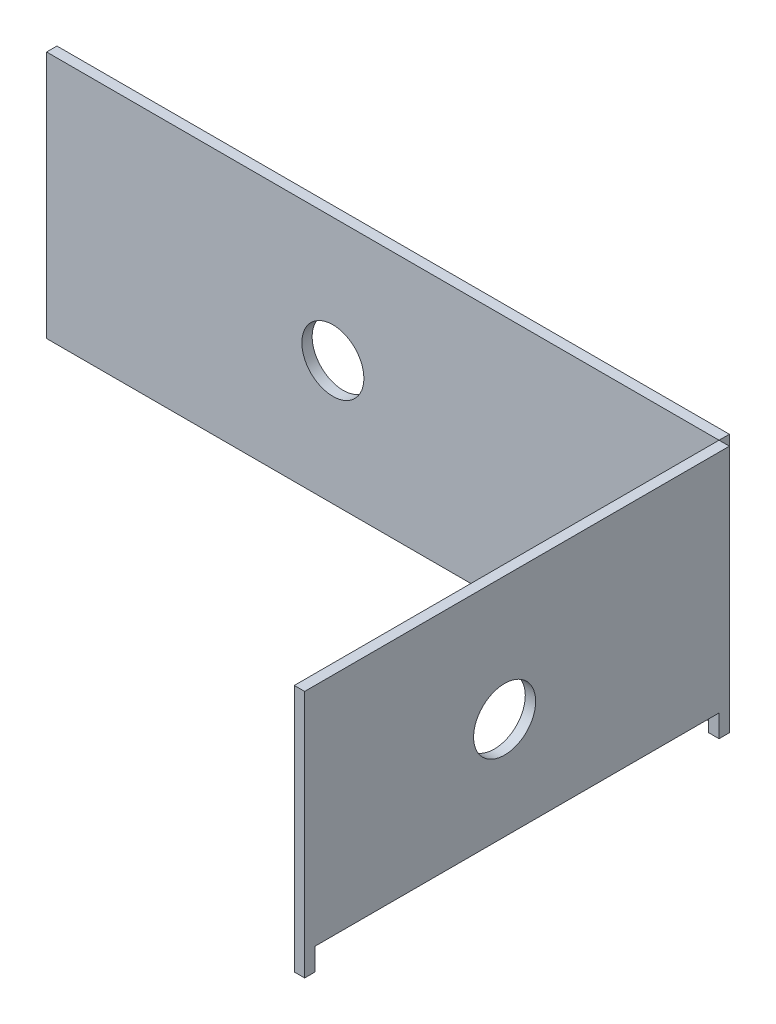
ISO-10303-21;
HEADER;
FILE_DESCRIPTION(('STEP AP214'),'2;1');
FILE_NAME('part.step','',(''),(''),'','','');
FILE_SCHEMA(('AUTOMOTIVE_DESIGN { 1 0 10303 214 1 1 1 1 }'));
ENDSEC;
DATA;
#1=APPLICATION_CONTEXT('core data for automotive mechanical design processes');
#2=APPLICATION_PROTOCOL_DEFINITION('international standard','automotive_design',2000,#1);
#3=PRODUCT_CONTEXT('',#1,'mechanical');
#4=PRODUCT('Part','Part','',(#3));
#5=PRODUCT_RELATED_PRODUCT_CATEGORY('part','',(#4));
#6=PRODUCT_DEFINITION_FORMATION('','',#4);
#7=PRODUCT_DEFINITION_CONTEXT('part definition',#1,'design');
#8=PRODUCT_DEFINITION('design','',#6,#7);
#9=PRODUCT_DEFINITION_SHAPE('','',#8);
#10=(LENGTH_UNIT() NAMED_UNIT(*) SI_UNIT(.MILLI.,.METRE.));
#11=(NAMED_UNIT(*) PLANE_ANGLE_UNIT() SI_UNIT($,.RADIAN.));
#12=(NAMED_UNIT(*) SI_UNIT($,.STERADIAN.) SOLID_ANGLE_UNIT());
#13=UNCERTAINTY_MEASURE_WITH_UNIT(LENGTH_MEASURE(1.E-05),#10,'distance_accuracy_value','');
#14=(GEOMETRIC_REPRESENTATION_CONTEXT(3) GLOBAL_UNCERTAINTY_ASSIGNED_CONTEXT((#13)) GLOBAL_UNIT_ASSIGNED_CONTEXT((#10,
#11,#12)) REPRESENTATION_CONTEXT('',''));
#15=CARTESIAN_POINT('',(0.,0.,0.));
#16=DIRECTION('',(0.,0.,1.));
#17=DIRECTION('',(1.,0.,0.));
#18=AXIS2_PLACEMENT_3D('',#15,#16,#17);
#19=CARTESIAN_POINT('',(169.541152356219,0.,0.));
#20=DIRECTION('',(-1.,0.,0.));
#21=DIRECTION('',(0.,0.,1.));
#22=AXIS2_PLACEMENT_3D('',#19,#20,#21);
#23=PLANE('',#22);
#24=DIRECTION('',(0.,1.,0.));
#25=VECTOR('',#24,1.);
#26=CARTESIAN_POINT('',(169.541152356219,0.,3.175));
#27=LINE('',#26,#25);
#28=CARTESIAN_POINT('',(169.541152356219,-76.2,3.175));
#29=VERTEX_POINT('',#28);
#30=CARTESIAN_POINT('',(169.541152356219,0.,3.175));
#31=VERTEX_POINT('',#30);
#32=EDGE_CURVE('E178',#29,#31,#27,.T.);
#33=ORIENTED_EDGE('',*,*,#32,.T.);
#34=DIRECTION('',(0.,0.,1.));
#35=VECTOR('',#34,1.);
#36=CARTESIAN_POINT('',(169.541152356219,0.,3.175));
#37=LINE('',#36,#35);
#38=CARTESIAN_POINT('',(169.541152356219,0.,133.5786));
#39=VERTEX_POINT('',#38);
#40=EDGE_CURVE('E126',#31,#39,#37,.T.);
#41=ORIENTED_EDGE('',*,*,#40,.T.);
#42=DIRECTION('',(0.,-1.,0.));
#43=VECTOR('',#42,1.);
#44=CARTESIAN_POINT('',(169.541152356219,-76.2,133.5786));
#45=LINE('',#44,#43);
#46=CARTESIAN_POINT('',(169.541152356219,-76.2,133.5786));
#47=VERTEX_POINT('',#46);
#48=EDGE_CURVE('E193',#39,#47,#45,.T.);
#49=ORIENTED_EDGE('',*,*,#48,.T.);
#50=DIRECTION('',(0.,0.,-1.));
#51=VECTOR('',#50,1.);
#52=CARTESIAN_POINT('',(169.541152356219,-76.2,130.4036));
#53=LINE('',#52,#51);
#54=CARTESIAN_POINT('',(169.541152356219,-76.2,130.4036));
#55=VERTEX_POINT('',#54);
#56=EDGE_CURVE('E206',#47,#55,#53,.T.);
#57=ORIENTED_EDGE('',*,*,#56,.T.);
#58=DIRECTION('',(0.,1.,0.));
#59=VECTOR('',#58,1.);
#60=CARTESIAN_POINT('',(169.541152356219,-69.342,130.4036));
#61=LINE('',#60,#59);
#62=CARTESIAN_POINT('',(169.541152356219,-69.342,130.4036));
#63=VERTEX_POINT('',#62);
#64=EDGE_CURVE('E145',#55,#63,#61,.T.);
#65=ORIENTED_EDGE('',*,*,#64,.T.);
#66=DIRECTION('',(0.,0.,-1.));
#67=VECTOR('',#66,1.);
#68=CARTESIAN_POINT('',(169.541152356219,-69.342,6.35));
#69=LINE('',#68,#67);
#70=CARTESIAN_POINT('',(169.541152356219,-69.342,6.35));
#71=VERTEX_POINT('',#70);
#72=EDGE_CURVE('E139',#63,#71,#69,.T.);
#73=ORIENTED_EDGE('',*,*,#72,.T.);
#74=DIRECTION('',(0.,-1.,0.));
#75=VECTOR('',#74,1.);
#76=CARTESIAN_POINT('',(169.541152356219,-76.2,6.35));
#77=LINE('',#76,#75);
#78=CARTESIAN_POINT('',(169.541152356219,-76.2,6.35));
#79=VERTEX_POINT('',#78);
#80=EDGE_CURVE('E143',#71,#79,#77,.T.);
#81=ORIENTED_EDGE('',*,*,#80,.T.);
#82=DIRECTION('',(0.,0.,-1.));
#83=VECTOR('',#82,1.);
#84=CARTESIAN_POINT('',(169.541152356219,-76.2,3.175));
#85=LINE('',#84,#83);
#86=EDGE_CURVE('E83',#79,#29,#85,.T.);
#87=ORIENTED_EDGE('',*,*,#86,.T.);
#88=EDGE_LOOP('',(#33,#41,#49,#57,#65,#73,#81,#87));
#89=FACE_BOUND('',#88,.T.);
#90=CARTESIAN_POINT('',(169.541152356219,-38.1,72.1868));
#91=DIRECTION('',(1.,0.,0.));
#92=DIRECTION('',(0.,0.,-1.));
#93=AXIS2_PLACEMENT_3D('',#90,#91,#92);
#94=CIRCLE('',#93,9.52500000000001);
#95=CARTESIAN_POINT('',(169.541152356219,-38.1,62.6618));
#96=VERTEX_POINT('',#95);
#97=EDGE_CURVE('E167',#96,#96,#94,.T.);
#98=ORIENTED_EDGE('',*,*,#97,.F.);
#99=EDGE_LOOP('',(#98));
#100=FACE_BOUND('',#99,.T.);
#101=ADVANCED_FACE('F66',(#89,#100),#23,.F.);
#102=CARTESIAN_POINT('',(166.366152356219,0.,0.));
#103=DIRECTION('',(-1.,0.,0.));
#104=DIRECTION('',(0.,0.,1.));
#105=AXIS2_PLACEMENT_3D('',#102,#103,#104);
#106=PLANE('',#105);
#107=DIRECTION('',(0.,1.,0.));
#108=VECTOR('',#107,1.);
#109=CARTESIAN_POINT('',(166.366152356219,0.,3.175));
#110=LINE('',#109,#108);
#111=CARTESIAN_POINT('',(166.366152356219,-76.2,3.175));
#112=VERTEX_POINT('',#111);
#113=CARTESIAN_POINT('',(166.366152356219,0.,3.175));
#114=VERTEX_POINT('',#113);
#115=EDGE_CURVE('E163',#112,#114,#110,.T.);
#116=ORIENTED_EDGE('',*,*,#115,.F.);
#117=DIRECTION('',(0.,0.,-1.));
#118=VECTOR('',#117,1.);
#119=CARTESIAN_POINT('',(166.366152356219,-76.2,3.175));
#120=LINE('',#119,#118);
#121=CARTESIAN_POINT('',(166.366152356219,-76.2,6.35));
#122=VERTEX_POINT('',#121);
#123=EDGE_CURVE('E118',#122,#112,#120,.T.);
#124=ORIENTED_EDGE('',*,*,#123,.F.);
#125=DIRECTION('',(0.,-1.,0.));
#126=VECTOR('',#125,1.);
#127=CARTESIAN_POINT('',(166.366152356219,-76.2,6.35));
#128=LINE('',#127,#126);
#129=CARTESIAN_POINT('',(166.366152356219,-69.342,6.35));
#130=VERTEX_POINT('',#129);
#131=EDGE_CURVE('E112',#130,#122,#128,.T.);
#132=ORIENTED_EDGE('',*,*,#131,.F.);
#133=DIRECTION('',(0.,0.,-1.));
#134=VECTOR('',#133,1.);
#135=CARTESIAN_POINT('',(166.366152356219,-69.342,6.35));
#136=LINE('',#135,#134);
#137=CARTESIAN_POINT('',(166.366152356219,-69.342,130.4036));
#138=VERTEX_POINT('',#137);
#139=EDGE_CURVE('E153',#138,#130,#136,.T.);
#140=ORIENTED_EDGE('',*,*,#139,.F.);
#141=DIRECTION('',(0.,1.,0.));
#142=VECTOR('',#141,1.);
#143=CARTESIAN_POINT('',(166.366152356219,-69.342,130.4036));
#144=LINE('',#143,#142);
#145=CARTESIAN_POINT('',(166.366152356219,-76.2,130.4036));
#146=VERTEX_POINT('',#145);
#147=EDGE_CURVE('E173',#146,#138,#144,.T.);
#148=ORIENTED_EDGE('',*,*,#147,.F.);
#149=DIRECTION('',(0.,0.,-1.));
#150=VECTOR('',#149,1.);
#151=CARTESIAN_POINT('',(166.366152356219,-76.2,130.4036));
#152=LINE('',#151,#150);
#153=CARTESIAN_POINT('',(166.366152356219,-76.2,133.5786));
#154=VERTEX_POINT('',#153);
#155=EDGE_CURVE('E171',#154,#146,#152,.T.);
#156=ORIENTED_EDGE('',*,*,#155,.F.);
#157=DIRECTION('',(0.,-1.,0.));
#158=VECTOR('',#157,1.);
#159=CARTESIAN_POINT('',(166.366152356219,-76.2,133.5786));
#160=LINE('',#159,#158);
#161=CARTESIAN_POINT('',(166.366152356219,0.,133.5786));
#162=VERTEX_POINT('',#161);
#163=EDGE_CURVE('E169',#162,#154,#160,.T.);
#164=ORIENTED_EDGE('',*,*,#163,.F.);
#165=DIRECTION('',(0.,0.,1.));
#166=VECTOR('',#165,1.);
#167=CARTESIAN_POINT('',(166.366152356219,0.,3.175));
#168=LINE('',#167,#166);
#169=EDGE_CURVE('E166',#114,#162,#168,.T.);
#170=ORIENTED_EDGE('',*,*,#169,.F.);
#171=EDGE_LOOP('',(#116,#124,#132,#140,#148,#156,#164,#170));
#172=FACE_BOUND('',#171,.T.);
#173=CARTESIAN_POINT('',(166.366152356219,-38.1,72.1868));
#174=DIRECTION('',(1.,0.,0.));
#175=DIRECTION('',(0.,0.,-1.));
#176=AXIS2_PLACEMENT_3D('',#173,#174,#175);
#177=CIRCLE('',#176,9.52500000000001);
#178=CARTESIAN_POINT('',(166.366152356219,-38.1,62.6618));
#179=VERTEX_POINT('',#178);
#180=EDGE_CURVE('E212',#179,#179,#177,.T.);
#181=ORIENTED_EDGE('',*,*,#180,.T.);
#182=EDGE_LOOP('',(#181));
#183=FACE_BOUND('',#182,.T.);
#184=ADVANCED_FACE('F197',(#172,#183),#106,.T.);
#185=CARTESIAN_POINT('',(169.541152356219,0.,3.175));
#186=DIRECTION('',(0.,0.,1.));
#187=DIRECTION('',(1.,0.,0.));
#188=AXIS2_PLACEMENT_3D('',#185,#186,#187);
#189=PLANE('',#188);
#190=ORIENTED_EDGE('',*,*,#115,.T.);
#191=DIRECTION('',(-1.,0.,0.));
#192=VECTOR('',#191,1.);
#193=CARTESIAN_POINT('',(169.541152356219,0.,3.175));
#194=LINE('',#193,#192);
#195=EDGE_CURVE('E13',#31,#114,#194,.T.);
#196=ORIENTED_EDGE('',*,*,#195,.F.);
#197=ORIENTED_EDGE('',*,*,#32,.F.);
#198=DIRECTION('',(-1.,0.,0.));
#199=VECTOR('',#198,1.);
#200=CARTESIAN_POINT('',(169.541152356219,-76.2,3.175));
#201=LINE('',#200,#199);
#202=EDGE_CURVE('E159',#29,#112,#201,.T.);
#203=ORIENTED_EDGE('',*,*,#202,.T.);
#204=EDGE_LOOP('',(#190,#196,#197,#203));
#205=FACE_BOUND('',#204,.T.);
#206=ADVANCED_FACE('F68',(#205),#189,.F.);
#207=CARTESIAN_POINT('',(169.541152356219,0.,3.175));
#208=DIRECTION('',(0.,-1.,0.));
#209=DIRECTION('',(0.,0.,-1.));
#210=AXIS2_PLACEMENT_3D('',#207,#208,#209);
#211=PLANE('',#210);
#212=ORIENTED_EDGE('',*,*,#169,.T.);
#213=DIRECTION('',(-1.,0.,0.));
#214=VECTOR('',#213,1.);
#215=CARTESIAN_POINT('',(169.541152356219,0.,133.5786));
#216=LINE('',#215,#214);
#217=EDGE_CURVE('E75',#39,#162,#216,.T.);
#218=ORIENTED_EDGE('',*,*,#217,.F.);
#219=ORIENTED_EDGE('',*,*,#40,.F.);
#220=ORIENTED_EDGE('',*,*,#195,.T.);
#221=EDGE_LOOP('',(#212,#218,#219,#220));
#222=FACE_BOUND('',#221,.T.);
#223=ADVANCED_FACE('F240',(#222),#211,.F.);
#224=CARTESIAN_POINT('',(169.541152356219,-76.2,133.5786));
#225=DIRECTION('',(0.,0.,-1.));
#226=DIRECTION('',(-1.,0.,0.));
#227=AXIS2_PLACEMENT_3D('',#224,#225,#226);
#228=PLANE('',#227);
#229=ORIENTED_EDGE('',*,*,#163,.T.);
#230=DIRECTION('',(-1.,0.,0.));
#231=VECTOR('',#230,1.);
#232=CARTESIAN_POINT('',(169.541152356219,-76.2,133.5786));
#233=LINE('',#232,#231);
#234=EDGE_CURVE('E185',#47,#154,#233,.T.);
#235=ORIENTED_EDGE('',*,*,#234,.F.);
#236=ORIENTED_EDGE('',*,*,#48,.F.);
#237=ORIENTED_EDGE('',*,*,#217,.T.);
#238=EDGE_LOOP('',(#229,#235,#236,#237));
#239=FACE_BOUND('',#238,.T.);
#240=ADVANCED_FACE('F191',(#239),#228,.F.);
#241=CARTESIAN_POINT('',(169.541152356219,-76.2,130.4036));
#242=DIRECTION('',(0.,1.,0.));
#243=DIRECTION('',(0.,0.,1.));
#244=AXIS2_PLACEMENT_3D('',#241,#242,#243);
#245=PLANE('',#244);
#246=ORIENTED_EDGE('',*,*,#155,.T.);
#247=DIRECTION('',(-1.,0.,0.));
#248=VECTOR('',#247,1.);
#249=CARTESIAN_POINT('',(169.541152356219,-76.2,130.4036));
#250=LINE('',#249,#248);
#251=EDGE_CURVE('E182',#55,#146,#250,.T.);
#252=ORIENTED_EDGE('',*,*,#251,.F.);
#253=ORIENTED_EDGE('',*,*,#56,.F.);
#254=ORIENTED_EDGE('',*,*,#234,.T.);
#255=EDGE_LOOP('',(#246,#252,#253,#254));
#256=FACE_BOUND('',#255,.T.);
#257=ADVANCED_FACE('F202',(#256),#245,.F.);
#258=CARTESIAN_POINT('',(169.541152356219,-69.342,130.4036));
#259=DIRECTION('',(0.,0.,1.));
#260=DIRECTION('',(1.,0.,0.));
#261=AXIS2_PLACEMENT_3D('',#258,#259,#260);
#262=PLANE('',#261);
#263=ORIENTED_EDGE('',*,*,#147,.T.);
#264=DIRECTION('',(-1.,0.,0.));
#265=VECTOR('',#264,1.);
#266=CARTESIAN_POINT('',(169.541152356219,-69.342,130.4036));
#267=LINE('',#266,#265);
#268=EDGE_CURVE('E154',#63,#138,#267,.T.);
#269=ORIENTED_EDGE('',*,*,#268,.F.);
#270=ORIENTED_EDGE('',*,*,#64,.F.);
#271=ORIENTED_EDGE('',*,*,#251,.T.);
#272=EDGE_LOOP('',(#263,#269,#270,#271));
#273=FACE_BOUND('',#272,.T.);
#274=ADVANCED_FACE('F205',(#273),#262,.F.);
#275=CARTESIAN_POINT('',(169.541152356219,-69.342,6.35));
#276=DIRECTION('',(0.,1.,0.));
#277=DIRECTION('',(0.,0.,1.));
#278=AXIS2_PLACEMENT_3D('',#275,#276,#277);
#279=PLANE('',#278);
#280=ORIENTED_EDGE('',*,*,#139,.T.);
#281=DIRECTION('',(-1.,0.,0.));
#282=VECTOR('',#281,1.);
#283=CARTESIAN_POINT('',(169.541152356219,-69.342,6.35));
#284=LINE('',#283,#282);
#285=EDGE_CURVE('E150',#71,#130,#284,.T.);
#286=ORIENTED_EDGE('',*,*,#285,.F.);
#287=ORIENTED_EDGE('',*,*,#72,.F.);
#288=ORIENTED_EDGE('',*,*,#268,.T.);
#289=EDGE_LOOP('',(#280,#286,#287,#288));
#290=FACE_BOUND('',#289,.T.);
#291=ADVANCED_FACE('F151',(#290),#279,.F.);
#292=CARTESIAN_POINT('',(169.541152356219,-76.2,6.35));
#293=DIRECTION('',(0.,0.,-1.));
#294=DIRECTION('',(-1.,0.,0.));
#295=AXIS2_PLACEMENT_3D('',#292,#293,#294);
#296=PLANE('',#295);
#297=ORIENTED_EDGE('',*,*,#131,.T.);
#298=DIRECTION('',(-1.,0.,0.));
#299=VECTOR('',#298,1.);
#300=CARTESIAN_POINT('',(169.541152356219,-76.2,6.35));
#301=LINE('',#300,#299);
#302=EDGE_CURVE('E155',#79,#122,#301,.T.);
#303=ORIENTED_EDGE('',*,*,#302,.F.);
#304=ORIENTED_EDGE('',*,*,#80,.F.);
#305=ORIENTED_EDGE('',*,*,#285,.T.);
#306=EDGE_LOOP('',(#297,#303,#304,#305));
#307=FACE_BOUND('',#306,.T.);
#308=ADVANCED_FACE('F157',(#307),#296,.F.);
#309=CARTESIAN_POINT('',(169.541152356219,-76.2,3.175));
#310=DIRECTION('',(0.,1.,0.));
#311=DIRECTION('',(0.,0.,1.));
#312=AXIS2_PLACEMENT_3D('',#309,#310,#311);
#313=PLANE('',#312);
#314=ORIENTED_EDGE('',*,*,#123,.T.);
#315=ORIENTED_EDGE('',*,*,#202,.F.);
#316=ORIENTED_EDGE('',*,*,#86,.F.);
#317=ORIENTED_EDGE('',*,*,#302,.T.);
#318=EDGE_LOOP('',(#314,#315,#316,#317));
#319=FACE_BOUND('',#318,.T.);
#320=ADVANCED_FACE('F228',(#319),#313,.F.);
#321=CARTESIAN_POINT('',(169.541152356219,-38.1,72.1868));
#322=DIRECTION('',(-1.,0.,0.));
#323=DIRECTION('',(0.,0.,1.));
#324=AXIS2_PLACEMENT_3D('',#321,#322,#323);
#325=CYLINDRICAL_SURFACE('',#324,9.52500000000001);
#326=ORIENTED_EDGE('',*,*,#97,.T.);
#327=EDGE_LOOP('',(#326));
#328=FACE_BOUND('',#327,.T.);
#329=ORIENTED_EDGE('',*,*,#180,.F.);
#330=EDGE_LOOP('',(#329));
#331=FACE_BOUND('',#330,.T.);
#332=ADVANCED_FACE('F218',(#328,#331),#325,.F.);
#333=CLOSED_SHELL('',(#101,#184,#206,#223,#240,#257,#274,#291,#308,#320,#332));
#334=MANIFOLD_SOLID_BREP('B2',#333);
#335=CARTESIAN_POINT('',(0.,0.,3.175));
#336=DIRECTION('',(0.,0.,1.));
#337=DIRECTION('',(1.,0.,0.));
#338=AXIS2_PLACEMENT_3D('',#335,#336,#337);
#339=PLANE('',#338);
#340=DIRECTION('',(1.,0.,0.));
#341=VECTOR('',#340,1.);
#342=CARTESIAN_POINT('',(-33.7350476437812,0.,3.175));
#343=LINE('',#342,#341);
#344=CARTESIAN_POINT('',(-40.0850476437812,0.,3.175));
#345=VERTEX_POINT('',#344);
#346=CARTESIAN_POINT('',(166.366152356219,0.,3.175));
#347=VERTEX_POINT('',#346);
#348=EDGE_CURVE('E334',#345,#347,#343,.T.);
#349=ORIENTED_EDGE('',*,*,#348,.F.);
#350=DIRECTION('',(0.,-1.,0.));
#351=VECTOR('',#350,1.);
#352=CARTESIAN_POINT('',(-40.0850476437812,0.,3.175));
#353=LINE('',#352,#351);
#354=CARTESIAN_POINT('',(-40.0850476437812,-76.2,3.175));
#355=VERTEX_POINT('',#354);
#356=EDGE_CURVE('E367',#345,#355,#353,.T.);
#357=ORIENTED_EDGE('',*,*,#356,.T.);
#358=DIRECTION('',(1.,0.,0.));
#359=VECTOR('',#358,1.);
#360=CARTESIAN_POINT('',(-40.0850476437812,-76.2,3.175));
#361=LINE('',#360,#359);
#362=CARTESIAN_POINT('',(166.366152356219,-76.2,3.175));
#363=VERTEX_POINT('',#362);
#364=EDGE_CURVE('E360',#355,#363,#361,.T.);
#365=ORIENTED_EDGE('',*,*,#364,.T.);
#366=DIRECTION('',(0.,1.,0.));
#367=VECTOR('',#366,1.);
#368=CARTESIAN_POINT('',(166.366152356219,-76.2,3.175));
#369=LINE('',#368,#367);
#370=EDGE_CURVE('E364',#363,#347,#369,.T.);
#371=ORIENTED_EDGE('',*,*,#370,.T.);
#372=EDGE_LOOP('',(#349,#357,#365,#371));
#373=FACE_BOUND('',#372,.T.);
#374=CARTESIAN_POINT('',(47.7989523562188,-38.1,3.175));
#375=DIRECTION('',(0.,0.,1.));
#376=DIRECTION('',(1.,0.,0.));
#377=AXIS2_PLACEMENT_3D('',#374,#375,#376);
#378=CIRCLE('',#377,9.525);
#379=CARTESIAN_POINT('',(57.3239523562188,-38.1,3.175));
#380=VERTEX_POINT('',#379);
#381=EDGE_CURVE('E385',#380,#380,#378,.T.);
#382=ORIENTED_EDGE('',*,*,#381,.F.);
#383=EDGE_LOOP('',(#382));
#384=FACE_BOUND('',#383,.T.);
#385=ADVANCED_FACE('F315',(#373,#384),#339,.T.);
#386=CARTESIAN_POINT('',(0.,0.,0.));
#387=DIRECTION('',(0.,0.,1.));
#388=DIRECTION('',(1.,0.,0.));
#389=AXIS2_PLACEMENT_3D('',#386,#387,#388);
#390=PLANE('',#389);
#391=DIRECTION('',(-1.,0.,0.));
#392=VECTOR('',#391,1.);
#393=CARTESIAN_POINT('',(-33.7350476437812,0.,0.));
#394=LINE('',#393,#392);
#395=CARTESIAN_POINT('',(166.366152356219,0.,0.));
#396=VERTEX_POINT('',#395);
#397=CARTESIAN_POINT('',(-40.0850476437812,0.,0.));
#398=VERTEX_POINT('',#397);
#399=EDGE_CURVE('E356',#396,#398,#394,.T.);
#400=ORIENTED_EDGE('',*,*,#399,.F.);
#401=DIRECTION('',(0.,1.,0.));
#402=VECTOR('',#401,1.);
#403=CARTESIAN_POINT('',(166.366152356219,-76.2,0.));
#404=LINE('',#403,#402);
#405=CARTESIAN_POINT('',(166.366152356219,-76.2,0.));
#406=VERTEX_POINT('',#405);
#407=EDGE_CURVE('E383',#406,#396,#404,.T.);
#408=ORIENTED_EDGE('',*,*,#407,.F.);
#409=DIRECTION('',(1.,0.,0.));
#410=VECTOR('',#409,1.);
#411=CARTESIAN_POINT('',(-40.0850476437812,-76.2,0.));
#412=LINE('',#411,#410);
#413=CARTESIAN_POINT('',(-40.0850476437812,-76.2,0.));
#414=VERTEX_POINT('',#413);
#415=EDGE_CURVE('E374',#414,#406,#412,.T.);
#416=ORIENTED_EDGE('',*,*,#415,.F.);
#417=DIRECTION('',(0.,-1.,0.));
#418=VECTOR('',#417,1.);
#419=CARTESIAN_POINT('',(-40.0850476437812,0.,0.));
#420=LINE('',#419,#418);
#421=EDGE_CURVE('E350',#398,#414,#420,.T.);
#422=ORIENTED_EDGE('',*,*,#421,.F.);
#423=EDGE_LOOP('',(#400,#408,#416,#422));
#424=FACE_BOUND('',#423,.T.);
#425=CARTESIAN_POINT('',(47.7989523562188,-38.1,0.));
#426=DIRECTION('',(0.,0.,1.));
#427=DIRECTION('',(1.,0.,0.));
#428=AXIS2_PLACEMENT_3D('',#425,#426,#427);
#429=CIRCLE('',#428,9.525);
#430=CARTESIAN_POINT('',(57.3239523562188,-38.1,0.));
#431=VERTEX_POINT('',#430);
#432=EDGE_CURVE('E418',#431,#431,#429,.T.);
#433=ORIENTED_EDGE('',*,*,#432,.T.);
#434=EDGE_LOOP('',(#433));
#435=FACE_BOUND('',#434,.T.);
#436=ADVANCED_FACE('F390',(#424,#435),#390,.F.);
#437=CARTESIAN_POINT('',(-33.7350476437812,0.,3.175));
#438=DIRECTION('',(0.,-1.,0.));
#439=DIRECTION('',(0.,0.,-1.));
#440=AXIS2_PLACEMENT_3D('',#437,#438,#439);
#441=PLANE('',#440);
#442=ORIENTED_EDGE('',*,*,#399,.T.);
#443=DIRECTION('',(0.,0.,-1.));
#444=VECTOR('',#443,1.);
#445=CARTESIAN_POINT('',(-40.0850476437812,0.,3.175));
#446=LINE('',#445,#444);
#447=EDGE_CURVE('E64',#345,#398,#446,.T.);
#448=ORIENTED_EDGE('',*,*,#447,.F.);
#449=ORIENTED_EDGE('',*,*,#348,.T.);
#450=DIRECTION('',(0.,0.,-1.));
#451=VECTOR('',#450,1.);
#452=CARTESIAN_POINT('',(166.366152356219,0.,3.175));
#453=LINE('',#452,#451);
#454=EDGE_CURVE('E319',#347,#396,#453,.T.);
#455=ORIENTED_EDGE('',*,*,#454,.T.);
#456=EDGE_LOOP('',(#442,#448,#449,#455));
#457=FACE_BOUND('',#456,.T.);
#458=ADVANCED_FACE('F392',(#457),#441,.F.);
#459=CARTESIAN_POINT('',(-40.0850476437812,0.,3.175));
#460=DIRECTION('',(1.,0.,0.));
#461=DIRECTION('',(0.,1.,0.));
#462=AXIS2_PLACEMENT_3D('',#459,#460,#461);
#463=PLANE('',#462);
#464=ORIENTED_EDGE('',*,*,#421,.T.);
#465=DIRECTION('',(0.,0.,-1.));
#466=VECTOR('',#465,1.);
#467=CARTESIAN_POINT('',(-40.0850476437812,-76.2,3.175));
#468=LINE('',#467,#466);
#469=EDGE_CURVE('E325',#355,#414,#468,.T.);
#470=ORIENTED_EDGE('',*,*,#469,.F.);
#471=ORIENTED_EDGE('',*,*,#356,.F.);
#472=ORIENTED_EDGE('',*,*,#447,.T.);
#473=EDGE_LOOP('',(#464,#470,#471,#472));
#474=FACE_BOUND('',#473,.T.);
#475=ADVANCED_FACE('F394',(#474),#463,.F.);
#476=CARTESIAN_POINT('',(-40.0850476437812,-76.2,3.175));
#477=DIRECTION('',(0.,1.,0.));
#478=DIRECTION('',(0.,0.,1.));
#479=AXIS2_PLACEMENT_3D('',#476,#477,#478);
#480=PLANE('',#479);
#481=ORIENTED_EDGE('',*,*,#415,.T.);
#482=DIRECTION('',(0.,0.,-1.));
#483=VECTOR('',#482,1.);
#484=CARTESIAN_POINT('',(166.366152356219,-76.2,3.175));
#485=LINE('',#484,#483);
#486=EDGE_CURVE('E371',#363,#406,#485,.T.);
#487=ORIENTED_EDGE('',*,*,#486,.F.);
#488=ORIENTED_EDGE('',*,*,#364,.F.);
#489=ORIENTED_EDGE('',*,*,#469,.T.);
#490=EDGE_LOOP('',(#481,#487,#488,#489));
#491=FACE_BOUND('',#490,.T.);
#492=ADVANCED_FACE('F372',(#491),#480,.F.);
#493=CARTESIAN_POINT('',(166.366152356219,-76.2,3.175));
#494=DIRECTION('',(-1.,0.,0.));
#495=DIRECTION('',(0.,0.,1.));
#496=AXIS2_PLACEMENT_3D('',#493,#494,#495);
#497=PLANE('',#496);
#498=ORIENTED_EDGE('',*,*,#407,.T.);
#499=ORIENTED_EDGE('',*,*,#454,.F.);
#500=ORIENTED_EDGE('',*,*,#370,.F.);
#501=ORIENTED_EDGE('',*,*,#486,.T.);
#502=EDGE_LOOP('',(#498,#499,#500,#501));
#503=FACE_BOUND('',#502,.T.);
#504=ADVANCED_FACE('F317',(#503),#497,.F.);
#505=CARTESIAN_POINT('',(47.7989523562188,-38.1,3.175));
#506=DIRECTION('',(0.,0.,-1.));
#507=DIRECTION('',(-1.,0.,0.));
#508=AXIS2_PLACEMENT_3D('',#505,#506,#507);
#509=CYLINDRICAL_SURFACE('',#508,9.525);
#510=ORIENTED_EDGE('',*,*,#381,.T.);
#511=EDGE_LOOP('',(#510));
#512=FACE_BOUND('',#511,.T.);
#513=ORIENTED_EDGE('',*,*,#432,.F.);
#514=EDGE_LOOP('',(#513));
#515=FACE_BOUND('',#514,.T.);
#516=ADVANCED_FACE('F407',(#512,#515),#509,.F.);
#517=CLOSED_SHELL('',(#385,#436,#458,#475,#492,#504,#516));
#518=MANIFOLD_SOLID_BREP('B7',#517);
#519=ADVANCED_BREP_SHAPE_REPRESENTATION('',(#18,#334,#518),#14);
#520=SHAPE_DEFINITION_REPRESENTATION(#9,#519);
ENDSEC;
END-ISO-10303-21;
